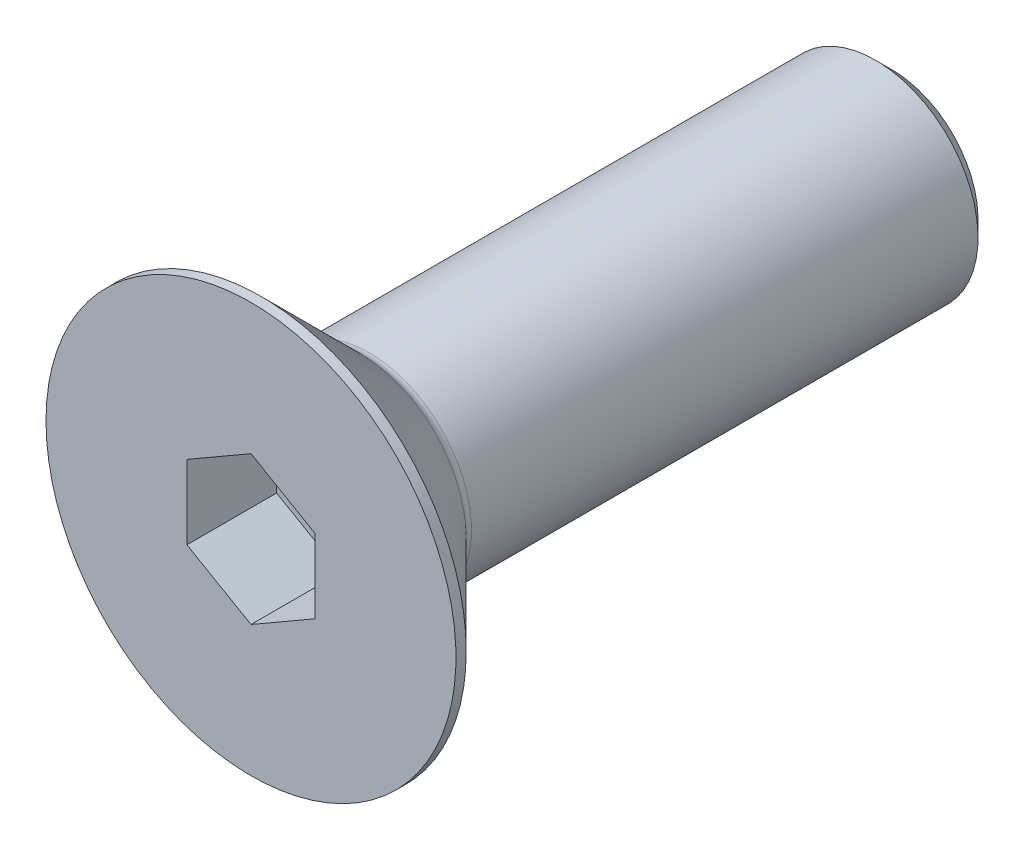
ISO-10303-21;
HEADER;
FILE_DESCRIPTION(('STEP AP214'),'2;1');
FILE_NAME('part.step','',(''),(''),'','','');
FILE_SCHEMA(('AUTOMOTIVE_DESIGN { 1 0 10303 214 1 1 1 1 }'));
ENDSEC;
DATA;
#1=APPLICATION_CONTEXT('core data for automotive mechanical design processes');
#2=APPLICATION_PROTOCOL_DEFINITION('international standard','automotive_design',2000,#1);
#3=PRODUCT_CONTEXT('',#1,'mechanical');
#4=PRODUCT('Part','Part','',(#3));
#5=PRODUCT_RELATED_PRODUCT_CATEGORY('part','',(#4));
#6=PRODUCT_DEFINITION_FORMATION('','',#4);
#7=PRODUCT_DEFINITION_CONTEXT('part definition',#1,'design');
#8=PRODUCT_DEFINITION('design','',#6,#7);
#9=PRODUCT_DEFINITION_SHAPE('','',#8);
#10=(LENGTH_UNIT() NAMED_UNIT(*) SI_UNIT(.MILLI.,.METRE.));
#11=(NAMED_UNIT(*) PLANE_ANGLE_UNIT() SI_UNIT($,.RADIAN.));
#12=(NAMED_UNIT(*) SI_UNIT($,.STERADIAN.) SOLID_ANGLE_UNIT());
#13=UNCERTAINTY_MEASURE_WITH_UNIT(LENGTH_MEASURE(1.E-05),#10,'distance_accuracy_value','');
#14=(GEOMETRIC_REPRESENTATION_CONTEXT(3) GLOBAL_UNCERTAINTY_ASSIGNED_CONTEXT((#13)) GLOBAL_UNIT_ASSIGNED_CONTEXT((#10,
#11,#12)) REPRESENTATION_CONTEXT('',''));
#15=CARTESIAN_POINT('',(0.,0.,0.));
#16=DIRECTION('',(0.,0.,1.));
#17=DIRECTION('',(1.,0.,0.));
#18=AXIS2_PLACEMENT_3D('',#15,#16,#17);
#19=CARTESIAN_POINT('',(0.,0.,-3.5));
#20=DIRECTION('',(0.,0.,1.));
#21=DIRECTION('',(1.,0.,0.));
#22=AXIS2_PLACEMENT_3D('',#19,#20,#21);
#23=PLANE('',#22);
#24=DIRECTION('',(-0.866025403784439,-0.5,0.));
#25=VECTOR('',#24,1.);
#26=CARTESIAN_POINT('',(0.,2.88675134594813,-3.5));
#27=LINE('',#26,#25);
#28=CARTESIAN_POINT('',(0.,2.88675134594813,-3.5));
#29=VERTEX_POINT('',#28);
#30=CARTESIAN_POINT('',(-2.5,1.44337567297406,-3.5));
#31=VERTEX_POINT('',#30);
#32=EDGE_CURVE('E81',#29,#31,#27,.T.);
#33=ORIENTED_EDGE('',*,*,#32,.T.);
#34=DIRECTION('',(0.,1.,0.));
#35=VECTOR('',#34,1.);
#36=CARTESIAN_POINT('',(-2.5,1.44337567297406,-3.5));
#37=LINE('',#36,#35);
#38=CARTESIAN_POINT('',(-2.5,-1.44337567297407,-3.5));
#39=VERTEX_POINT('',#38);
#40=EDGE_CURVE('E65',#31,#39,#37,.F.);
#41=ORIENTED_EDGE('',*,*,#40,.T.);
#42=DIRECTION('',(0.866025403784439,-0.499999999999999,0.));
#43=VECTOR('',#42,1.);
#44=CARTESIAN_POINT('',(-2.5,-1.44337567297407,-3.5));
#45=LINE('',#44,#43);
#46=CARTESIAN_POINT('',(0.,-2.88675134594813,-3.5));
#47=VERTEX_POINT('',#46);
#48=EDGE_CURVE('E70',#39,#47,#45,.T.);
#49=ORIENTED_EDGE('',*,*,#48,.T.);
#50=DIRECTION('',(0.866025403784439,0.5,0.));
#51=VECTOR('',#50,1.);
#52=CARTESIAN_POINT('',(0.,-2.88675134594813,-3.5));
#53=LINE('',#52,#51);
#54=CARTESIAN_POINT('',(2.5,-1.44337567297406,-3.5));
#55=VERTEX_POINT('',#54);
#56=EDGE_CURVE('E128',#47,#55,#53,.T.);
#57=ORIENTED_EDGE('',*,*,#56,.T.);
#58=DIRECTION('',(0.,1.,0.));
#59=VECTOR('',#58,1.);
#60=CARTESIAN_POINT('',(2.5,-1.44337567297406,-3.5));
#61=LINE('',#60,#59);
#62=CARTESIAN_POINT('',(2.5,1.44337567297407,-3.5));
#63=VERTEX_POINT('',#62);
#64=EDGE_CURVE('E132',#55,#63,#61,.T.);
#65=ORIENTED_EDGE('',*,*,#64,.T.);
#66=DIRECTION('',(-0.866025403784439,0.499999999999999,0.));
#67=VECTOR('',#66,1.);
#68=CARTESIAN_POINT('',(2.5,1.44337567297407,-3.5));
#69=LINE('',#68,#67);
#70=EDGE_CURVE('E137',#63,#29,#69,.T.);
#71=ORIENTED_EDGE('',*,*,#70,.T.);
#72=EDGE_LOOP('',(#33,#41,#49,#57,#65,#71));
#73=FACE_BOUND('',#72,.T.);
#74=ADVANCED_FACE('F14',(#73),#23,.T.);
#75=CARTESIAN_POINT('',(-2.5,-1.44337567297407,0.));
#76=DIRECTION('',(-0.499999999999999,-0.866025403784439,0.));
#77=DIRECTION('',(0.866025403784439,-0.499999999999999,0.));
#78=AXIS2_PLACEMENT_3D('',#75,#76,#77);
#79=PLANE('',#78);
#80=DIRECTION('',(0.,0.,1.));
#81=VECTOR('',#80,1.);
#82=CARTESIAN_POINT('',(-2.5,-1.44337567297407,0.));
#83=LINE('',#82,#81);
#84=CARTESIAN_POINT('',(-2.5,-1.44337567297407,0.));
#85=VERTEX_POINT('',#84);
#86=EDGE_CURVE('E72',#39,#85,#83,.T.);
#87=ORIENTED_EDGE('',*,*,#86,.T.);
#88=DIRECTION('',(-0.866025403784439,0.499999999999999,0.));
#89=VECTOR('',#88,1.);
#90=CARTESIAN_POINT('',(0.,-2.88675134594813,0.));
#91=LINE('',#90,#89);
#92=CARTESIAN_POINT('',(0.,-2.88675134594813,0.));
#93=VERTEX_POINT('',#92);
#94=EDGE_CURVE('E126',#93,#85,#91,.T.);
#95=ORIENTED_EDGE('',*,*,#94,.F.);
#96=DIRECTION('',(0.,0.,1.));
#97=VECTOR('',#96,1.);
#98=CARTESIAN_POINT('',(0.,-2.88675134594813,0.));
#99=LINE('',#98,#97);
#100=EDGE_CURVE('E75',#93,#47,#99,.F.);
#101=ORIENTED_EDGE('',*,*,#100,.T.);
#102=ORIENTED_EDGE('',*,*,#48,.F.);
#103=EDGE_LOOP('',(#87,#95,#101,#102));
#104=FACE_BOUND('',#103,.T.);
#105=ADVANCED_FACE('F71',(#104),#79,.F.);
#106=CARTESIAN_POINT('',(-2.5,1.44337567297406,0.));
#107=DIRECTION('',(-1.,0.,0.));
#108=DIRECTION('',(0.,0.,1.));
#109=AXIS2_PLACEMENT_3D('',#106,#107,#108);
#110=PLANE('',#109);
#111=DIRECTION('',(0.,0.,1.));
#112=VECTOR('',#111,1.);
#113=CARTESIAN_POINT('',(-2.5,1.44337567297406,0.));
#114=LINE('',#113,#112);
#115=CARTESIAN_POINT('',(-2.5,1.44337567297406,0.));
#116=VERTEX_POINT('',#115);
#117=EDGE_CURVE('E83',#31,#116,#114,.T.);
#118=ORIENTED_EDGE('',*,*,#117,.T.);
#119=DIRECTION('',(0.,1.,0.));
#120=VECTOR('',#119,1.);
#121=CARTESIAN_POINT('',(-2.5,0.,0.));
#122=LINE('',#121,#120);
#123=EDGE_CURVE('E87',#85,#116,#122,.T.);
#124=ORIENTED_EDGE('',*,*,#123,.F.);
#125=ORIENTED_EDGE('',*,*,#86,.F.);
#126=ORIENTED_EDGE('',*,*,#40,.F.);
#127=EDGE_LOOP('',(#118,#124,#125,#126));
#128=FACE_BOUND('',#127,.T.);
#129=ADVANCED_FACE('F85',(#128),#110,.F.);
#130=CARTESIAN_POINT('',(0.,2.88675134594813,0.));
#131=DIRECTION('',(-0.5,0.866025403784439,0.));
#132=DIRECTION('',(-0.866025403784439,-0.5,0.));
#133=AXIS2_PLACEMENT_3D('',#130,#131,#132);
#134=PLANE('',#133);
#135=DIRECTION('',(0.,0.,1.));
#136=VECTOR('',#135,1.);
#137=CARTESIAN_POINT('',(0.,2.88675134594813,0.));
#138=LINE('',#137,#136);
#139=CARTESIAN_POINT('',(0.,2.88675134594813,0.));
#140=VERTEX_POINT('',#139);
#141=EDGE_CURVE('E139',#29,#140,#138,.T.);
#142=ORIENTED_EDGE('',*,*,#141,.T.);
#143=DIRECTION('',(0.866025403784439,0.499999999999999,0.));
#144=VECTOR('',#143,1.);
#145=CARTESIAN_POINT('',(-2.5,1.44337567297406,0.));
#146=LINE('',#145,#144);
#147=EDGE_CURVE('E122',#116,#140,#146,.T.);
#148=ORIENTED_EDGE('',*,*,#147,.F.);
#149=ORIENTED_EDGE('',*,*,#117,.F.);
#150=ORIENTED_EDGE('',*,*,#32,.F.);
#151=EDGE_LOOP('',(#142,#148,#149,#150));
#152=FACE_BOUND('',#151,.T.);
#153=ADVANCED_FACE('F143',(#152),#134,.F.);
#154=CARTESIAN_POINT('',(2.5,1.44337567297407,0.));
#155=DIRECTION('',(0.499999999999999,0.866025403784439,0.));
#156=DIRECTION('',(-0.866025403784439,0.499999999999999,0.));
#157=AXIS2_PLACEMENT_3D('',#154,#155,#156);
#158=PLANE('',#157);
#159=DIRECTION('',(0.,0.,-1.));
#160=VECTOR('',#159,1.);
#161=CARTESIAN_POINT('',(2.5,1.44337567297407,0.));
#162=LINE('',#161,#160);
#163=CARTESIAN_POINT('',(2.5,1.44337567297407,0.));
#164=VERTEX_POINT('',#163);
#165=EDGE_CURVE('E135',#63,#164,#162,.F.);
#166=ORIENTED_EDGE('',*,*,#165,.T.);
#167=DIRECTION('',(0.866025403784439,-0.499999999999999,0.));
#168=VECTOR('',#167,1.);
#169=CARTESIAN_POINT('',(0.,2.88675134594813,0.));
#170=LINE('',#169,#168);
#171=EDGE_CURVE('E119',#140,#164,#170,.T.);
#172=ORIENTED_EDGE('',*,*,#171,.F.);
#173=ORIENTED_EDGE('',*,*,#141,.F.);
#174=ORIENTED_EDGE('',*,*,#70,.F.);
#175=EDGE_LOOP('',(#166,#172,#173,#174));
#176=FACE_BOUND('',#175,.T.);
#177=ADVANCED_FACE('F154',(#176),#158,.F.);
#178=CARTESIAN_POINT('',(2.5,-1.44337567297406,0.));
#179=DIRECTION('',(1.,0.,0.));
#180=DIRECTION('',(0.,0.,-1.));
#181=AXIS2_PLACEMENT_3D('',#178,#179,#180);
#182=PLANE('',#181);
#183=DIRECTION('',(0.,0.,1.));
#184=VECTOR('',#183,1.);
#185=CARTESIAN_POINT('',(2.5,-1.44337567297406,0.));
#186=LINE('',#185,#184);
#187=CARTESIAN_POINT('',(2.5,-1.44337567297406,0.));
#188=VERTEX_POINT('',#187);
#189=EDGE_CURVE('E33',#55,#188,#186,.T.);
#190=ORIENTED_EDGE('',*,*,#189,.T.);
#191=DIRECTION('',(0.,1.,0.));
#192=VECTOR('',#191,1.);
#193=CARTESIAN_POINT('',(2.5,0.,0.));
#194=LINE('',#193,#192);
#195=EDGE_CURVE('E116',#164,#188,#194,.F.);
#196=ORIENTED_EDGE('',*,*,#195,.F.);
#197=ORIENTED_EDGE('',*,*,#165,.F.);
#198=ORIENTED_EDGE('',*,*,#64,.F.);
#199=EDGE_LOOP('',(#190,#196,#197,#198));
#200=FACE_BOUND('',#199,.T.);
#201=ADVANCED_FACE('F152',(#200),#182,.F.);
#202=CARTESIAN_POINT('',(0.,-2.88675134594813,0.));
#203=DIRECTION('',(0.5,-0.866025403784439,0.));
#204=DIRECTION('',(0.866025403784439,0.5,0.));
#205=AXIS2_PLACEMENT_3D('',#202,#203,#204);
#206=PLANE('',#205);
#207=ORIENTED_EDGE('',*,*,#100,.F.);
#208=DIRECTION('',(-0.866025403784439,-0.499999999999999,0.));
#209=VECTOR('',#208,1.);
#210=CARTESIAN_POINT('',(2.5,-1.44337567297406,0.));
#211=LINE('',#210,#209);
#212=EDGE_CURVE('E113',#188,#93,#211,.T.);
#213=ORIENTED_EDGE('',*,*,#212,.F.);
#214=ORIENTED_EDGE('',*,*,#189,.F.);
#215=ORIENTED_EDGE('',*,*,#56,.F.);
#216=EDGE_LOOP('',(#207,#213,#214,#215));
#217=FACE_BOUND('',#216,.T.);
#218=ADVANCED_FACE('F150',(#217),#206,.F.);
#219=CARTESIAN_POINT('',(4.,0.,0.));
#220=DIRECTION('',(0.,0.,1.));
#221=DIRECTION('',(1.,0.,0.));
#222=AXIS2_PLACEMENT_3D('',#219,#220,#221);
#223=PLANE('',#222);
#224=ORIENTED_EDGE('',*,*,#195,.T.);
#225=ORIENTED_EDGE('',*,*,#212,.T.);
#226=ORIENTED_EDGE('',*,*,#94,.T.);
#227=ORIENTED_EDGE('',*,*,#123,.T.);
#228=ORIENTED_EDGE('',*,*,#147,.T.);
#229=ORIENTED_EDGE('',*,*,#171,.T.);
#230=EDGE_LOOP('',(#224,#225,#226,#227,#228,#229));
#231=FACE_BOUND('',#230,.T.);
#232=CARTESIAN_POINT('',(0.,0.,0.));
#233=DIRECTION('',(0.,0.,-1.));
#234=DIRECTION('',(-1.,0.,0.));
#235=AXIS2_PLACEMENT_3D('',#232,#233,#234);
#236=CIRCLE('',#235,8.);
#237=CARTESIAN_POINT('',(-8.,0.,0.));
#238=VERTEX_POINT('',#237);
#239=EDGE_CURVE('E18',#238,#238,#236,.T.);
#240=ORIENTED_EDGE('',*,*,#239,.F.);
#241=EDGE_LOOP('',(#240));
#242=FACE_BOUND('',#241,.T.);
#243=ADVANCED_FACE('F147',(#231,#242),#223,.T.);
#244=CARTESIAN_POINT('',(0.,0.,-0.2));
#245=DIRECTION('',(0.,0.,-1.));
#246=DIRECTION('',(-1.,0.,0.));
#247=AXIS2_PLACEMENT_3D('',#244,#245,#246);
#248=CYLINDRICAL_SURFACE('',#247,8.);
#249=ORIENTED_EDGE('',*,*,#239,.T.);
#250=EDGE_LOOP('',(#249));
#251=FACE_BOUND('',#250,.T.);
#252=CARTESIAN_POINT('',(0.,0.,-0.399999998251133));
#253=DIRECTION('',(0.,0.,1.));
#254=DIRECTION('',(1.,0.,0.));
#255=AXIS2_PLACEMENT_3D('',#252,#253,#254);
#256=CIRCLE('',#255,7.99999999821921);
#257=CARTESIAN_POINT('',(7.99999999821921,0.,-0.399999998251133));
#258=VERTEX_POINT('',#257);
#259=EDGE_CURVE('E100',#258,#258,#256,.F.);
#260=ORIENTED_EDGE('',*,*,#259,.F.);
#261=EDGE_LOOP('',(#260));
#262=FACE_BOUND('',#261,.T.);
#263=ADVANCED_FACE('F182',(#251,#262),#248,.T.);
#264=CARTESIAN_POINT('',(0.,0.,-0.399999998251133));
#265=DIRECTION('',(0.,0.,1.));
#266=DIRECTION('',(1.,0.,0.));
#267=AXIS2_PLACEMENT_3D('',#264,#265,#266);
#268=CONICAL_SURFACE('',#267,7.99999999821921,0.785398162505018);
#269=CARTESIAN_POINT('',(0.,0.,-4.25355339059328));
#270=DIRECTION('',(0.,0.,-1.));
#271=DIRECTION('',(0.,1.,0.));
#272=AXIS2_PLACEMENT_3D('',#269,#270,#271);
#273=CIRCLE('',#272,4.14644660940673);
#274=CARTESIAN_POINT('',(0.,4.14644660940673,-4.25355339059328));
#275=VERTEX_POINT('',#274);
#276=EDGE_CURVE('E93',#275,#275,#273,.T.);
#277=ORIENTED_EDGE('',*,*,#276,.F.);
#278=EDGE_LOOP('',(#277));
#279=FACE_BOUND('',#278,.T.);
#280=ORIENTED_EDGE('',*,*,#259,.T.);
#281=EDGE_LOOP('',(#280));
#282=FACE_BOUND('',#281,.T.);
#283=ADVANCED_FACE('F178',(#279,#282),#268,.T.);
#284=CARTESIAN_POINT('',(2.,0.,-25.));
#285=DIRECTION('',(0.,0.,-1.));
#286=DIRECTION('',(-1.,0.,0.));
#287=AXIS2_PLACEMENT_3D('',#284,#285,#286);
#288=PLANE('',#287);
#289=CARTESIAN_POINT('',(0.,0.,-25.0000000003183));
#290=DIRECTION('',(0.,0.,1.));
#291=DIRECTION('',(0.,-1.,0.));
#292=AXIS2_PLACEMENT_3D('',#289,#290,#291);
#293=CIRCLE('',#292,3.37500000028967);
#294=CARTESIAN_POINT('',(0.,-3.37500000028967,-25.0000000003183));
#295=VERTEX_POINT('',#294);
#296=EDGE_CURVE('E91',#295,#295,#293,.T.);
#297=ORIENTED_EDGE('',*,*,#296,.F.);
#298=EDGE_LOOP('',(#297));
#299=FACE_BOUND('',#298,.T.);
#300=ADVANCED_FACE('F175',(#299),#288,.T.);
#301=CARTESIAN_POINT('',(0.,0.,-4.60710678118655));
#302=DIRECTION('',(0.,0.,-1.));
#303=DIRECTION('',(-1.,0.,0.));
#304=AXIS2_PLACEMENT_3D('',#301,#302,#303);
#305=TOROIDAL_SURFACE('',#304,4.5,0.5);
#306=CARTESIAN_POINT('',(0.,0.,-4.60710678118655));
#307=DIRECTION('',(0.,0.,-1.));
#308=DIRECTION('',(-1.,0.,0.));
#309=AXIS2_PLACEMENT_3D('',#306,#307,#308);
#310=CIRCLE('',#309,4.);
#311=CARTESIAN_POINT('',(-4.,0.,-4.60710678118655));
#312=VERTEX_POINT('',#311);
#313=EDGE_CURVE('E24',#312,#312,#310,.T.);
#314=ORIENTED_EDGE('',*,*,#313,.F.);
#315=EDGE_LOOP('',(#314));
#316=FACE_BOUND('',#315,.T.);
#317=ORIENTED_EDGE('',*,*,#276,.T.);
#318=EDGE_LOOP('',(#317));
#319=FACE_BOUND('',#318,.T.);
#320=ADVANCED_FACE('F16',(#316,#319),#305,.F.);
#321=CARTESIAN_POINT('',(0.,0.,-24.3749999997362));
#322=DIRECTION('',(0.,0.,1.));
#323=DIRECTION('',(0.,-1.,0.));
#324=AXIS2_PLACEMENT_3D('',#321,#322,#323);
#325=CONICAL_SURFACE('',#324,3.99999999973488,0.785398162487954);
#326=ORIENTED_EDGE('',*,*,#296,.T.);
#327=EDGE_LOOP('',(#326));
#328=FACE_BOUND('',#327,.T.);
#329=CARTESIAN_POINT('',(0.,0.,-24.375));
#330=DIRECTION('',(0.,0.,-1.));
#331=DIRECTION('',(-1.,0.,0.));
#332=AXIS2_PLACEMENT_3D('',#329,#330,#331);
#333=CIRCLE('',#332,4.);
#334=CARTESIAN_POINT('',(-4.,0.,-24.375));
#335=VERTEX_POINT('',#334);
#336=EDGE_CURVE('E9',#335,#335,#333,.F.);
#337=ORIENTED_EDGE('',*,*,#336,.F.);
#338=EDGE_LOOP('',(#337));
#339=FACE_BOUND('',#338,.T.);
#340=ADVANCED_FACE('F166',(#328,#339),#325,.T.);
#341=CARTESIAN_POINT('',(0.,0.,-14.7));
#342=DIRECTION('',(0.,0.,-1.));
#343=DIRECTION('',(-1.,0.,0.));
#344=AXIS2_PLACEMENT_3D('',#341,#342,#343);
#345=CYLINDRICAL_SURFACE('',#344,4.);
#346=ORIENTED_EDGE('',*,*,#336,.T.);
#347=EDGE_LOOP('',(#346));
#348=FACE_BOUND('',#347,.T.);
#349=ORIENTED_EDGE('',*,*,#313,.T.);
#350=EDGE_LOOP('',(#349));
#351=FACE_BOUND('',#350,.T.);
#352=ADVANCED_FACE('F164',(#348,#351),#345,.T.);
#353=CLOSED_SHELL('',(#74,#105,#129,#153,#177,#201,#218,#243,#263,#283,#300,#320,#340,#352));
#354=MANIFOLD_SOLID_BREP('B1',#353);
#355=ADVANCED_BREP_SHAPE_REPRESENTATION('',(#18,#354),#14);
#356=SHAPE_DEFINITION_REPRESENTATION(#9,#355);
ENDSEC;
END-ISO-10303-21;
